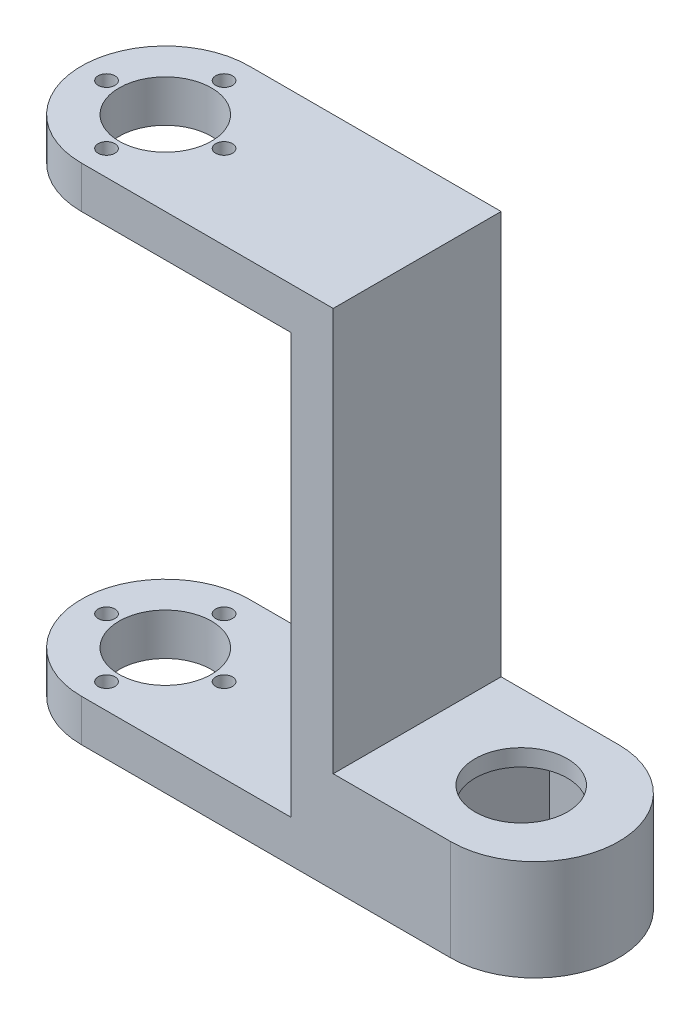
ISO-10303-21;
HEADER;
FILE_DESCRIPTION(('STEP AP214'),'2;1');
FILE_NAME('part.step','',(''),(''),'','','');
FILE_SCHEMA(('AUTOMOTIVE_DESIGN { 1 0 10303 214 1 1 1 1 }'));
ENDSEC;
DATA;
#1=APPLICATION_CONTEXT('core data for automotive mechanical design processes');
#2=APPLICATION_PROTOCOL_DEFINITION('international standard','automotive_design',2000,#1);
#3=PRODUCT_CONTEXT('',#1,'mechanical');
#4=PRODUCT('Part','Part','',(#3));
#5=PRODUCT_RELATED_PRODUCT_CATEGORY('part','',(#4));
#6=PRODUCT_DEFINITION_FORMATION('','',#4);
#7=PRODUCT_DEFINITION_CONTEXT('part definition',#1,'design');
#8=PRODUCT_DEFINITION('design','',#6,#7);
#9=PRODUCT_DEFINITION_SHAPE('','',#8);
#10=(LENGTH_UNIT() NAMED_UNIT(*) SI_UNIT(.MILLI.,.METRE.));
#11=(NAMED_UNIT(*) PLANE_ANGLE_UNIT() SI_UNIT($,.RADIAN.));
#12=(NAMED_UNIT(*) SI_UNIT($,.STERADIAN.) SOLID_ANGLE_UNIT());
#13=UNCERTAINTY_MEASURE_WITH_UNIT(LENGTH_MEASURE(1.E-05),#10,'distance_accuracy_value','');
#14=(GEOMETRIC_REPRESENTATION_CONTEXT(3) GLOBAL_UNCERTAINTY_ASSIGNED_CONTEXT((#13)) GLOBAL_UNIT_ASSIGNED_CONTEXT((#10,
#11,#12)) REPRESENTATION_CONTEXT('',''));
#15=CARTESIAN_POINT('',(0.,0.,0.));
#16=DIRECTION('',(0.,0.,1.));
#17=DIRECTION('',(1.,0.,0.));
#18=AXIS2_PLACEMENT_3D('',#15,#16,#17);
#19=CARTESIAN_POINT('',(34.,-30.,10.));
#20=DIRECTION('',(0.,-1.,0.));
#21=DIRECTION('',(1.,0.,0.));
#22=AXIS2_PLACEMENT_3D('',#19,#20,#21);
#23=CYLINDRICAL_SURFACE('',#22,10.);
#24=DIRECTION('',(0.,-1.,0.));
#25=VECTOR('',#24,1.);
#26=CARTESIAN_POINT('',(34.,0.,20.));
#27=LINE('',#26,#25);
#28=CARTESIAN_POINT('',(34.,-30.,20.));
#29=VERTEX_POINT('',#28);
#30=CARTESIAN_POINT('',(34.,-18.,20.));
#31=VERTEX_POINT('',#30);
#32=EDGE_CURVE('E327',#29,#31,#27,.F.);
#33=ORIENTED_EDGE('',*,*,#32,.F.);
#34=CARTESIAN_POINT('',(34.,-30.,10.));
#35=DIRECTION('',(0.,1.,0.));
#36=DIRECTION('',(-1.,0.,0.));
#37=AXIS2_PLACEMENT_3D('',#34,#35,#36);
#38=CIRCLE('',#37,10.);
#39=CARTESIAN_POINT('',(34.,-30.,0.));
#40=VERTEX_POINT('',#39);
#41=EDGE_CURVE('E45',#40,#29,#38,.F.);
#42=ORIENTED_EDGE('',*,*,#41,.F.);
#43=DIRECTION('',(0.,1.,0.));
#44=VECTOR('',#43,1.);
#45=CARTESIAN_POINT('',(34.,-30.,0.));
#46=LINE('',#45,#44);
#47=CARTESIAN_POINT('',(34.,-18.,0.));
#48=VERTEX_POINT('',#47);
#49=EDGE_CURVE('E342',#48,#40,#46,.F.);
#50=ORIENTED_EDGE('',*,*,#49,.F.);
#51=CARTESIAN_POINT('',(34.,-18.,10.));
#52=DIRECTION('',(0.,-1.,0.));
#53=DIRECTION('',(1.,0.,0.));
#54=AXIS2_PLACEMENT_3D('',#51,#52,#53);
#55=CIRCLE('',#54,10.);
#56=EDGE_CURVE('E11',#31,#48,#55,.F.);
#57=ORIENTED_EDGE('',*,*,#56,.F.);
#58=EDGE_LOOP('',(#33,#42,#50,#57));
#59=FACE_BOUND('',#58,.T.);
#60=ADVANCED_FACE('F37',(#59),#23,.T.);
#61=CARTESIAN_POINT('',(-10.,-25.,10.));
#62=DIRECTION('',(0.,-1.,0.));
#63=DIRECTION('',(1.,0.,0.));
#64=AXIS2_PLACEMENT_3D('',#61,#62,#63);
#65=CYLINDRICAL_SURFACE('',#64,10.);
#66=DIRECTION('',(0.,1.,0.));
#67=VECTOR('',#66,1.);
#68=CARTESIAN_POINT('',(-10.,-25.,20.));
#69=LINE('',#68,#67);
#70=CARTESIAN_POINT('',(-10.,-25.,20.));
#71=VERTEX_POINT('',#70);
#72=CARTESIAN_POINT('',(-9.99999999999999,-30.,20.));
#73=VERTEX_POINT('',#72);
#74=EDGE_CURVE('E317',#71,#73,#69,.F.);
#75=ORIENTED_EDGE('',*,*,#74,.F.);
#76=CARTESIAN_POINT('',(-10.,-25.,10.));
#77=DIRECTION('',(0.,-1.,0.));
#78=DIRECTION('',(0.,0.,-1.));
#79=AXIS2_PLACEMENT_3D('',#76,#77,#78);
#80=CIRCLE('',#79,10.);
#81=CARTESIAN_POINT('',(-10.,-25.,0.));
#82=VERTEX_POINT('',#81);
#83=EDGE_CURVE('E323',#82,#71,#80,.F.);
#84=ORIENTED_EDGE('',*,*,#83,.F.);
#85=DIRECTION('',(0.,-1.,0.));
#86=VECTOR('',#85,1.);
#87=CARTESIAN_POINT('',(-10.0000000000001,0.,0.));
#88=LINE('',#87,#86);
#89=CARTESIAN_POINT('',(-9.99999999999999,-30.,0.));
#90=VERTEX_POINT('',#89);
#91=EDGE_CURVE('E320',#90,#82,#88,.F.);
#92=ORIENTED_EDGE('',*,*,#91,.F.);
#93=CARTESIAN_POINT('',(-9.99999999999999,-30.,10.));
#94=DIRECTION('',(0.,1.,0.));
#95=DIRECTION('',(-1.,0.,0.));
#96=AXIS2_PLACEMENT_3D('',#93,#94,#95);
#97=CIRCLE('',#96,10.);
#98=EDGE_CURVE('E325',#73,#90,#97,.F.);
#99=ORIENTED_EDGE('',*,*,#98,.F.);
#100=EDGE_LOOP('',(#75,#84,#92,#99));
#101=FACE_BOUND('',#100,.T.);
#102=ADVANCED_FACE('F351',(#101),#65,.T.);
#103=CARTESIAN_POINT('',(-10.,30.,10.));
#104=DIRECTION('',(0.,-1.,0.));
#105=DIRECTION('',(0.,0.,-1.));
#106=AXIS2_PLACEMENT_3D('',#103,#104,#105);
#107=CYLINDRICAL_SURFACE('',#106,10.);
#108=DIRECTION('',(0.,1.,0.));
#109=VECTOR('',#108,1.);
#110=CARTESIAN_POINT('',(-10.,30.,20.));
#111=LINE('',#110,#109);
#112=CARTESIAN_POINT('',(-10.,30.,20.));
#113=VERTEX_POINT('',#112);
#114=CARTESIAN_POINT('',(-10.,25.,20.));
#115=VERTEX_POINT('',#114);
#116=EDGE_CURVE('E307',#113,#115,#111,.F.);
#117=ORIENTED_EDGE('',*,*,#116,.F.);
#118=CARTESIAN_POINT('',(-10.,30.,10.));
#119=DIRECTION('',(0.,-1.,0.));
#120=DIRECTION('',(1.,0.,0.));
#121=AXIS2_PLACEMENT_3D('',#118,#119,#120);
#122=CIRCLE('',#121,10.);
#123=CARTESIAN_POINT('',(-10.,30.,0.));
#124=VERTEX_POINT('',#123);
#125=EDGE_CURVE('E313',#124,#113,#122,.F.);
#126=ORIENTED_EDGE('',*,*,#125,.F.);
#127=DIRECTION('',(0.,-1.,0.));
#128=VECTOR('',#127,1.);
#129=CARTESIAN_POINT('',(-10.,0.,0.));
#130=LINE('',#129,#128);
#131=CARTESIAN_POINT('',(-10.,25.,0.));
#132=VERTEX_POINT('',#131);
#133=EDGE_CURVE('E310',#132,#124,#130,.F.);
#134=ORIENTED_EDGE('',*,*,#133,.F.);
#135=CARTESIAN_POINT('',(-10.,25.,10.));
#136=DIRECTION('',(0.,1.,0.));
#137=DIRECTION('',(-1.,0.,0.));
#138=AXIS2_PLACEMENT_3D('',#135,#136,#137);
#139=CIRCLE('',#138,10.);
#140=EDGE_CURVE('E315',#115,#132,#139,.F.);
#141=ORIENTED_EDGE('',*,*,#140,.F.);
#142=EDGE_LOOP('',(#117,#126,#134,#141));
#143=FACE_BOUND('',#142,.T.);
#144=ADVANCED_FACE('F370',(#143),#107,.T.);
#145=CARTESIAN_POINT('',(15.,25.,20.));
#146=DIRECTION('',(1.,0.,0.));
#147=DIRECTION('',(0.,1.,0.));
#148=AXIS2_PLACEMENT_3D('',#145,#146,#147);
#149=PLANE('',#148);
#150=DIRECTION('',(0.,-1.,0.));
#151=VECTOR('',#150,1.);
#152=CARTESIAN_POINT('',(15.,25.,0.));
#153=LINE('',#152,#151);
#154=CARTESIAN_POINT('',(15.,25.,0.));
#155=VERTEX_POINT('',#154);
#156=CARTESIAN_POINT('',(15.,-25.,0.));
#157=VERTEX_POINT('',#156);
#158=EDGE_CURVE('E266',#155,#157,#153,.T.);
#159=ORIENTED_EDGE('',*,*,#158,.T.);
#160=DIRECTION('',(0.,0.,-1.));
#161=VECTOR('',#160,1.);
#162=CARTESIAN_POINT('',(15.,-25.,20.));
#163=LINE('',#162,#161);
#164=CARTESIAN_POINT('',(15.,-25.,20.));
#165=VERTEX_POINT('',#164);
#166=EDGE_CURVE('E304',#165,#157,#163,.T.);
#167=ORIENTED_EDGE('',*,*,#166,.F.);
#168=DIRECTION('',(0.,-1.,0.));
#169=VECTOR('',#168,1.);
#170=CARTESIAN_POINT('',(15.,25.,20.));
#171=LINE('',#170,#169);
#172=CARTESIAN_POINT('',(15.,25.,20.));
#173=VERTEX_POINT('',#172);
#174=EDGE_CURVE('E267',#173,#165,#171,.T.);
#175=ORIENTED_EDGE('',*,*,#174,.F.);
#176=DIRECTION('',(0.,0.,-1.));
#177=VECTOR('',#176,1.);
#178=CARTESIAN_POINT('',(15.,25.,20.));
#179=LINE('',#178,#177);
#180=EDGE_CURVE('E284',#173,#155,#179,.T.);
#181=ORIENTED_EDGE('',*,*,#180,.T.);
#182=EDGE_LOOP('',(#159,#167,#175,#181));
#183=FACE_BOUND('',#182,.T.);
#184=ADVANCED_FACE('F378',(#183),#149,.F.);
#185=CARTESIAN_POINT('',(-15.,-25.,20.));
#186=DIRECTION('',(0.,-1.,0.));
#187=DIRECTION('',(0.,0.,-1.));
#188=AXIS2_PLACEMENT_3D('',#185,#186,#187);
#189=PLANE('',#188);
#190=CARTESIAN_POINT('',(-10.,-25.,3.));
#191=DIRECTION('',(0.,-1.,0.));
#192=DIRECTION('',(0.,0.,-1.));
#193=AXIS2_PLACEMENT_3D('',#190,#191,#192);
#194=CIRCLE('',#193,1.);
#195=CARTESIAN_POINT('',(-10.,-25.,2.));
#196=VERTEX_POINT('',#195);
#197=EDGE_CURVE('E263',#196,#196,#194,.T.);
#198=ORIENTED_EDGE('',*,*,#197,.T.);
#199=EDGE_LOOP('',(#198));
#200=FACE_BOUND('',#199,.T.);
#201=CARTESIAN_POINT('',(-10.,-25.,10.));
#202=DIRECTION('',(0.,-1.,0.));
#203=DIRECTION('',(0.,0.,-1.));
#204=AXIS2_PLACEMENT_3D('',#201,#202,#203);
#205=CIRCLE('',#204,5.5);
#206=CARTESIAN_POINT('',(-10.,-25.,4.5));
#207=VERTEX_POINT('',#206);
#208=EDGE_CURVE('E259',#207,#207,#205,.T.);
#209=ORIENTED_EDGE('',*,*,#208,.T.);
#210=EDGE_LOOP('',(#209));
#211=FACE_BOUND('',#210,.T.);
#212=CARTESIAN_POINT('',(-3.,-25.,10.));
#213=DIRECTION('',(0.,-1.,0.));
#214=DIRECTION('',(0.,0.,-1.));
#215=AXIS2_PLACEMENT_3D('',#212,#213,#214);
#216=CIRCLE('',#215,1.);
#217=CARTESIAN_POINT('',(-3.,-25.,9.));
#218=VERTEX_POINT('',#217);
#219=EDGE_CURVE('E255',#218,#218,#216,.T.);
#220=ORIENTED_EDGE('',*,*,#219,.T.);
#221=EDGE_LOOP('',(#220));
#222=FACE_BOUND('',#221,.T.);
#223=CARTESIAN_POINT('',(-10.,-25.,17.));
#224=DIRECTION('',(0.,-1.,0.));
#225=DIRECTION('',(0.,0.,-1.));
#226=AXIS2_PLACEMENT_3D('',#223,#224,#225);
#227=CIRCLE('',#226,1.);
#228=CARTESIAN_POINT('',(-10.,-25.,16.));
#229=VERTEX_POINT('',#228);
#230=EDGE_CURVE('E251',#229,#229,#227,.T.);
#231=ORIENTED_EDGE('',*,*,#230,.T.);
#232=EDGE_LOOP('',(#231));
#233=FACE_BOUND('',#232,.T.);
#234=CARTESIAN_POINT('',(-17.,-25.,10.));
#235=DIRECTION('',(0.,-1.,0.));
#236=DIRECTION('',(0.,0.,-1.));
#237=AXIS2_PLACEMENT_3D('',#234,#235,#236);
#238=CIRCLE('',#237,1.);
#239=CARTESIAN_POINT('',(-17.,-25.,9.));
#240=VERTEX_POINT('',#239);
#241=EDGE_CURVE('E247',#240,#240,#238,.T.);
#242=ORIENTED_EDGE('',*,*,#241,.T.);
#243=EDGE_LOOP('',(#242));
#244=FACE_BOUND('',#243,.T.);
#245=DIRECTION('',(-1.,0.,0.));
#246=VECTOR('',#245,1.);
#247=CARTESIAN_POINT('',(-15.,-25.,0.));
#248=LINE('',#247,#246);
#249=EDGE_CURVE('E287',#157,#82,#248,.T.);
#250=ORIENTED_EDGE('',*,*,#249,.T.);
#251=ORIENTED_EDGE('',*,*,#83,.T.);
#252=DIRECTION('',(-1.,0.,0.));
#253=VECTOR('',#252,1.);
#254=CARTESIAN_POINT('',(-15.,-25.,20.));
#255=LINE('',#254,#253);
#256=EDGE_CURVE('E270',#165,#71,#255,.T.);
#257=ORIENTED_EDGE('',*,*,#256,.F.);
#258=ORIENTED_EDGE('',*,*,#166,.T.);
#259=EDGE_LOOP('',(#250,#251,#257,#258));
#260=FACE_BOUND('',#259,.T.);
#261=ADVANCED_FACE('F381',(#200,#211,#222,#233,#244,#260),#189,.F.);
#262=CARTESIAN_POINT('',(-20.,-30.,20.));
#263=DIRECTION('',(0.,1.,0.));
#264=DIRECTION('',(-1.,0.,0.));
#265=AXIS2_PLACEMENT_3D('',#262,#263,#264);
#266=PLANE('',#265);
#267=DIRECTION('',(0.500839461349423,0.,0.865540197769705));
#268=VECTOR('',#267,1.);
#269=CARTESIAN_POINT('',(37.1297855594556,-30.,1.09502198501678));
#270=LINE('',#269,#268);
#271=CARTESIAN_POINT('',(37.1297855594556,-30.,1.09502198501678));
#272=VERTEX_POINT('',#271);
#273=CARTESIAN_POINT('',(42.2768299608452,-30.,9.99003560296349));
#274=VERTEX_POINT('',#273);
#275=EDGE_CURVE('E188',#272,#274,#270,.T.);
#276=ORIENTED_EDGE('',*,*,#275,.F.);
#277=DIRECTION('',(0.999999529939883,0.,-0.000969597861462165));
#278=VECTOR('',#277,1.);
#279=CARTESIAN_POINT('',(26.8529555986104,-30.,1.1049863820533));
#280=LINE('',#279,#278);
#281=CARTESIAN_POINT('',(26.8529555986104,-30.,1.1049863820533));
#282=VERTEX_POINT('',#281);
#283=EDGE_CURVE('E154',#282,#272,#280,.T.);
#284=ORIENTED_EDGE('',*,*,#283,.F.);
#285=DIRECTION('',(0.49916006859046,0.,-0.866509795631167));
#286=VECTOR('',#285,1.);
#287=CARTESIAN_POINT('',(21.7231700391548,-30.,10.0099643970365));
#288=LINE('',#287,#286);
#289=CARTESIAN_POINT('',(21.7231700391548,-30.,10.0099643970365));
#290=VERTEX_POINT('',#289);
#291=EDGE_CURVE('E172',#290,#282,#288,.T.);
#292=ORIENTED_EDGE('',*,*,#291,.F.);
#293=DIRECTION('',(-0.500839461349423,0.,-0.865540197769705));
#294=VECTOR('',#293,1.);
#295=CARTESIAN_POINT('',(26.8702144405444,-30.,18.9049780149832));
#296=LINE('',#295,#294);
#297=CARTESIAN_POINT('',(26.8702144405444,-30.,18.9049780149832));
#298=VERTEX_POINT('',#297);
#299=EDGE_CURVE('E175',#298,#290,#296,.T.);
#300=ORIENTED_EDGE('',*,*,#299,.F.);
#301=DIRECTION('',(-0.999999529939883,0.,0.00096959786146227));
#302=VECTOR('',#301,1.);
#303=CARTESIAN_POINT('',(37.1470444013896,-30.,18.8950136179467));
#304=LINE('',#303,#302);
#305=CARTESIAN_POINT('',(37.1470444013896,-30.,18.8950136179467));
#306=VERTEX_POINT('',#305);
#307=EDGE_CURVE('E194',#306,#298,#304,.T.);
#308=ORIENTED_EDGE('',*,*,#307,.F.);
#309=DIRECTION('',(-0.499160068590461,0.,0.866509795631167));
#310=VECTOR('',#309,1.);
#311=CARTESIAN_POINT('',(42.2768299608452,-30.,9.99003560296349));
#312=LINE('',#311,#310);
#313=EDGE_CURVE('E191',#274,#306,#312,.T.);
#314=ORIENTED_EDGE('',*,*,#313,.F.);
#315=EDGE_LOOP('',(#276,#284,#292,#300,#308,#314));
#316=FACE_BOUND('',#315,.T.);
#317=CARTESIAN_POINT('',(-9.99999999999999,-30.,3.));
#318=DIRECTION('',(0.,1.,0.));
#319=DIRECTION('',(-1.,0.,0.));
#320=AXIS2_PLACEMENT_3D('',#317,#318,#319);
#321=CIRCLE('',#320,1.);
#322=CARTESIAN_POINT('',(-11.,-30.,3.));
#323=VERTEX_POINT('',#322);
#324=EDGE_CURVE('E217',#323,#323,#321,.T.);
#325=ORIENTED_EDGE('',*,*,#324,.T.);
#326=EDGE_LOOP('',(#325));
#327=FACE_BOUND('',#326,.T.);
#328=CARTESIAN_POINT('',(-9.99999999999999,-30.,10.));
#329=DIRECTION('',(0.,1.,0.));
#330=DIRECTION('',(-1.,0.,0.));
#331=AXIS2_PLACEMENT_3D('',#328,#329,#330);
#332=CIRCLE('',#331,5.5);
#333=CARTESIAN_POINT('',(-15.5,-30.,10.));
#334=VERTEX_POINT('',#333);
#335=EDGE_CURVE('E232',#334,#334,#332,.T.);
#336=ORIENTED_EDGE('',*,*,#335,.T.);
#337=EDGE_LOOP('',(#336));
#338=FACE_BOUND('',#337,.T.);
#339=CARTESIAN_POINT('',(-2.99999999999999,-30.,10.));
#340=DIRECTION('',(0.,1.,0.));
#341=DIRECTION('',(-1.,0.,0.));
#342=AXIS2_PLACEMENT_3D('',#339,#340,#341);
#343=CIRCLE('',#342,1.);
#344=CARTESIAN_POINT('',(-3.99999999999999,-30.,10.));
#345=VERTEX_POINT('',#344);
#346=EDGE_CURVE('E225',#345,#345,#343,.T.);
#347=ORIENTED_EDGE('',*,*,#346,.T.);
#348=EDGE_LOOP('',(#347));
#349=FACE_BOUND('',#348,.T.);
#350=CARTESIAN_POINT('',(-9.99999999999999,-30.,17.));
#351=DIRECTION('',(0.,1.,0.));
#352=DIRECTION('',(-1.,0.,0.));
#353=AXIS2_PLACEMENT_3D('',#350,#351,#352);
#354=CIRCLE('',#353,1.);
#355=CARTESIAN_POINT('',(-11.,-30.,17.));
#356=VERTEX_POINT('',#355);
#357=EDGE_CURVE('E242',#356,#356,#354,.T.);
#358=ORIENTED_EDGE('',*,*,#357,.T.);
#359=EDGE_LOOP('',(#358));
#360=FACE_BOUND('',#359,.T.);
#361=CARTESIAN_POINT('',(-17.,-30.,10.));
#362=DIRECTION('',(0.,1.,0.));
#363=DIRECTION('',(-1.,0.,0.));
#364=AXIS2_PLACEMENT_3D('',#361,#362,#363);
#365=CIRCLE('',#364,1.);
#366=CARTESIAN_POINT('',(-18.,-30.,10.));
#367=VERTEX_POINT('',#366);
#368=EDGE_CURVE('E224',#367,#367,#365,.T.);
#369=ORIENTED_EDGE('',*,*,#368,.T.);
#370=EDGE_LOOP('',(#369));
#371=FACE_BOUND('',#370,.T.);
#372=DIRECTION('',(1.,0.,0.));
#373=VECTOR('',#372,1.);
#374=CARTESIAN_POINT('',(-20.,-30.,0.));
#375=LINE('',#374,#373);
#376=EDGE_CURVE('E290',#90,#40,#375,.T.);
#377=ORIENTED_EDGE('',*,*,#376,.T.);
#378=ORIENTED_EDGE('',*,*,#41,.T.);
#379=DIRECTION('',(1.,0.,0.));
#380=VECTOR('',#379,1.);
#381=CARTESIAN_POINT('',(-20.,-30.,20.));
#382=LINE('',#381,#380);
#383=EDGE_CURVE('E274',#73,#29,#382,.T.);
#384=ORIENTED_EDGE('',*,*,#383,.F.);
#385=ORIENTED_EDGE('',*,*,#98,.T.);
#386=EDGE_LOOP('',(#377,#378,#384,#385));
#387=FACE_BOUND('',#386,.T.);
#388=ADVANCED_FACE('F345',(#316,#327,#338,#349,#360,#371,#387),#266,.F.);
#389=CARTESIAN_POINT('',(20.,30.,20.));
#390=DIRECTION('',(-1.,0.,0.));
#391=DIRECTION('',(0.,-1.,0.));
#392=AXIS2_PLACEMENT_3D('',#389,#390,#391);
#393=PLANE('',#392);
#394=DIRECTION('',(0.,1.,0.));
#395=VECTOR('',#394,1.);
#396=CARTESIAN_POINT('',(20.,30.,20.));
#397=LINE('',#396,#395);
#398=CARTESIAN_POINT('',(20.,-18.,20.));
#399=VERTEX_POINT('',#398);
#400=CARTESIAN_POINT('',(20.,30.,20.));
#401=VERTEX_POINT('',#400);
#402=EDGE_CURVE('E277',#399,#401,#397,.T.);
#403=ORIENTED_EDGE('',*,*,#402,.F.);
#404=DIRECTION('',(0.,0.,-1.));
#405=VECTOR('',#404,1.);
#406=CARTESIAN_POINT('',(20.,-18.,20.));
#407=LINE('',#406,#405);
#408=CARTESIAN_POINT('',(20.,-18.,0.));
#409=VERTEX_POINT('',#408);
#410=EDGE_CURVE('E201',#399,#409,#407,.T.);
#411=ORIENTED_EDGE('',*,*,#410,.T.);
#412=DIRECTION('',(0.,1.,0.));
#413=VECTOR('',#412,1.);
#414=CARTESIAN_POINT('',(20.,30.,0.));
#415=LINE('',#414,#413);
#416=CARTESIAN_POINT('',(20.,30.,0.));
#417=VERTEX_POINT('',#416);
#418=EDGE_CURVE('E293',#409,#417,#415,.T.);
#419=ORIENTED_EDGE('',*,*,#418,.T.);
#420=DIRECTION('',(0.,0.,-1.));
#421=VECTOR('',#420,1.);
#422=CARTESIAN_POINT('',(20.,30.,20.));
#423=LINE('',#422,#421);
#424=EDGE_CURVE('E301',#401,#417,#423,.T.);
#425=ORIENTED_EDGE('',*,*,#424,.F.);
#426=EDGE_LOOP('',(#403,#411,#419,#425));
#427=FACE_BOUND('',#426,.T.);
#428=ADVANCED_FACE('F361',(#427),#393,.F.);
#429=CARTESIAN_POINT('',(-20.,30.,20.));
#430=DIRECTION('',(0.,-1.,0.));
#431=DIRECTION('',(1.,0.,0.));
#432=AXIS2_PLACEMENT_3D('',#429,#430,#431);
#433=PLANE('',#432);
#434=CARTESIAN_POINT('',(-10.,30.,3.));
#435=DIRECTION('',(0.,1.,0.));
#436=DIRECTION('',(-1.,0.,0.));
#437=AXIS2_PLACEMENT_3D('',#434,#435,#436);
#438=CIRCLE('',#437,1.);
#439=CARTESIAN_POINT('',(-11.,30.,3.));
#440=VERTEX_POINT('',#439);
#441=EDGE_CURVE('E221',#440,#440,#438,.T.);
#442=ORIENTED_EDGE('',*,*,#441,.F.);
#443=EDGE_LOOP('',(#442));
#444=FACE_BOUND('',#443,.T.);
#445=CARTESIAN_POINT('',(-10.,30.,10.));
#446=DIRECTION('',(0.,1.,0.));
#447=DIRECTION('',(-1.,0.,0.));
#448=AXIS2_PLACEMENT_3D('',#445,#446,#447);
#449=CIRCLE('',#448,5.5);
#450=CARTESIAN_POINT('',(-15.5,30.,10.));
#451=VERTEX_POINT('',#450);
#452=EDGE_CURVE('E216',#451,#451,#449,.T.);
#453=ORIENTED_EDGE('',*,*,#452,.F.);
#454=EDGE_LOOP('',(#453));
#455=FACE_BOUND('',#454,.T.);
#456=CARTESIAN_POINT('',(-3.00000000000001,30.,10.));
#457=DIRECTION('',(0.,1.,0.));
#458=DIRECTION('',(-1.,0.,0.));
#459=AXIS2_PLACEMENT_3D('',#456,#457,#458);
#460=CIRCLE('',#459,1.);
#461=CARTESIAN_POINT('',(-4.00000000000001,30.,10.));
#462=VERTEX_POINT('',#461);
#463=EDGE_CURVE('E229',#462,#462,#460,.T.);
#464=ORIENTED_EDGE('',*,*,#463,.F.);
#465=EDGE_LOOP('',(#464));
#466=FACE_BOUND('',#465,.T.);
#467=CARTESIAN_POINT('',(-10.,30.,17.));
#468=DIRECTION('',(0.,1.,0.));
#469=DIRECTION('',(-1.,0.,0.));
#470=AXIS2_PLACEMENT_3D('',#467,#468,#469);
#471=CIRCLE('',#470,1.);
#472=CARTESIAN_POINT('',(-11.,30.,17.));
#473=VERTEX_POINT('',#472);
#474=EDGE_CURVE('E228',#473,#473,#471,.T.);
#475=ORIENTED_EDGE('',*,*,#474,.F.);
#476=EDGE_LOOP('',(#475));
#477=FACE_BOUND('',#476,.T.);
#478=CARTESIAN_POINT('',(-17.,30.,10.));
#479=DIRECTION('',(0.,1.,0.));
#480=DIRECTION('',(-1.,0.,0.));
#481=AXIS2_PLACEMENT_3D('',#478,#479,#480);
#482=CIRCLE('',#481,1.);
#483=CARTESIAN_POINT('',(-18.,30.,10.));
#484=VERTEX_POINT('',#483);
#485=EDGE_CURVE('E239',#484,#484,#482,.T.);
#486=ORIENTED_EDGE('',*,*,#485,.F.);
#487=EDGE_LOOP('',(#486));
#488=FACE_BOUND('',#487,.T.);
#489=DIRECTION('',(-1.,0.,0.));
#490=VECTOR('',#489,1.);
#491=CARTESIAN_POINT('',(-20.,30.,0.));
#492=LINE('',#491,#490);
#493=EDGE_CURVE('E295',#417,#124,#492,.T.);
#494=ORIENTED_EDGE('',*,*,#493,.T.);
#495=ORIENTED_EDGE('',*,*,#125,.T.);
#496=DIRECTION('',(-1.,0.,0.));
#497=VECTOR('',#496,1.);
#498=CARTESIAN_POINT('',(-20.,30.,20.));
#499=LINE('',#498,#497);
#500=EDGE_CURVE('E279',#401,#113,#499,.T.);
#501=ORIENTED_EDGE('',*,*,#500,.F.);
#502=ORIENTED_EDGE('',*,*,#424,.T.);
#503=EDGE_LOOP('',(#494,#495,#501,#502));
#504=FACE_BOUND('',#503,.T.);
#505=ADVANCED_FACE('F367',(#444,#455,#466,#477,#488,#504),#433,.F.);
#506=CARTESIAN_POINT('',(-15.,25.,20.));
#507=DIRECTION('',(0.,1.,0.));
#508=DIRECTION('',(-1.,0.,0.));
#509=AXIS2_PLACEMENT_3D('',#506,#507,#508);
#510=PLANE('',#509);
#511=CARTESIAN_POINT('',(-10.,25.,3.));
#512=DIRECTION('',(0.,1.,0.));
#513=DIRECTION('',(-1.,0.,0.));
#514=AXIS2_PLACEMENT_3D('',#511,#512,#513);
#515=CIRCLE('',#514,1.);
#516=CARTESIAN_POINT('',(-11.,25.,3.));
#517=VERTEX_POINT('',#516);
#518=EDGE_CURVE('E262',#517,#517,#515,.T.);
#519=ORIENTED_EDGE('',*,*,#518,.T.);
#520=EDGE_LOOP('',(#519));
#521=FACE_BOUND('',#520,.T.);
#522=CARTESIAN_POINT('',(-10.,25.,10.));
#523=DIRECTION('',(0.,1.,0.));
#524=DIRECTION('',(-1.,0.,0.));
#525=AXIS2_PLACEMENT_3D('',#522,#523,#524);
#526=CIRCLE('',#525,5.5);
#527=CARTESIAN_POINT('',(-15.5,25.,10.));
#528=VERTEX_POINT('',#527);
#529=EDGE_CURVE('E258',#528,#528,#526,.T.);
#530=ORIENTED_EDGE('',*,*,#529,.T.);
#531=EDGE_LOOP('',(#530));
#532=FACE_BOUND('',#531,.T.);
#533=CARTESIAN_POINT('',(-3.00000000000001,25.,10.));
#534=DIRECTION('',(0.,1.,0.));
#535=DIRECTION('',(-1.,0.,0.));
#536=AXIS2_PLACEMENT_3D('',#533,#534,#535);
#537=CIRCLE('',#536,1.);
#538=CARTESIAN_POINT('',(-4.00000000000001,25.,10.));
#539=VERTEX_POINT('',#538);
#540=EDGE_CURVE('E254',#539,#539,#537,.T.);
#541=ORIENTED_EDGE('',*,*,#540,.T.);
#542=EDGE_LOOP('',(#541));
#543=FACE_BOUND('',#542,.T.);
#544=CARTESIAN_POINT('',(-10.,25.,17.));
#545=DIRECTION('',(0.,1.,0.));
#546=DIRECTION('',(-1.,0.,0.));
#547=AXIS2_PLACEMENT_3D('',#544,#545,#546);
#548=CIRCLE('',#547,1.);
#549=CARTESIAN_POINT('',(-11.,25.,17.));
#550=VERTEX_POINT('',#549);
#551=EDGE_CURVE('E250',#550,#550,#548,.T.);
#552=ORIENTED_EDGE('',*,*,#551,.T.);
#553=EDGE_LOOP('',(#552));
#554=FACE_BOUND('',#553,.T.);
#555=CARTESIAN_POINT('',(-17.,25.,10.));
#556=DIRECTION('',(0.,1.,0.));
#557=DIRECTION('',(-1.,0.,0.));
#558=AXIS2_PLACEMENT_3D('',#555,#556,#557);
#559=CIRCLE('',#558,1.);
#560=CARTESIAN_POINT('',(-18.,25.,10.));
#561=VERTEX_POINT('',#560);
#562=EDGE_CURVE('E220',#561,#561,#559,.T.);
#563=ORIENTED_EDGE('',*,*,#562,.T.);
#564=EDGE_LOOP('',(#563));
#565=FACE_BOUND('',#564,.T.);
#566=DIRECTION('',(1.,0.,0.));
#567=VECTOR('',#566,1.);
#568=CARTESIAN_POINT('',(-15.,25.,20.));
#569=LINE('',#568,#567);
#570=EDGE_CURVE('E282',#115,#173,#569,.T.);
#571=ORIENTED_EDGE('',*,*,#570,.F.);
#572=ORIENTED_EDGE('',*,*,#140,.T.);
#573=DIRECTION('',(1.,0.,0.));
#574=VECTOR('',#573,1.);
#575=CARTESIAN_POINT('',(-15.,25.,0.));
#576=LINE('',#575,#574);
#577=EDGE_CURVE('E271',#132,#155,#576,.T.);
#578=ORIENTED_EDGE('',*,*,#577,.T.);
#579=ORIENTED_EDGE('',*,*,#180,.F.);
#580=EDGE_LOOP('',(#571,#572,#578,#579));
#581=FACE_BOUND('',#580,.T.);
#582=ADVANCED_FACE('F373',(#521,#532,#543,#554,#565,#581),#510,.F.);
#583=CARTESIAN_POINT('',(0.,0.,20.));
#584=DIRECTION('',(0.,0.,1.));
#585=DIRECTION('',(1.,0.,0.));
#586=AXIS2_PLACEMENT_3D('',#583,#584,#585);
#587=PLANE('',#586);
#588=ORIENTED_EDGE('',*,*,#383,.T.);
#589=ORIENTED_EDGE('',*,*,#32,.T.);
#590=DIRECTION('',(-1.,0.,0.));
#591=VECTOR('',#590,1.);
#592=CARTESIAN_POINT('',(20.,-18.,20.));
#593=LINE('',#592,#591);
#594=EDGE_CURVE('E214',#31,#399,#593,.T.);
#595=ORIENTED_EDGE('',*,*,#594,.T.);
#596=ORIENTED_EDGE('',*,*,#402,.T.);
#597=ORIENTED_EDGE('',*,*,#500,.T.);
#598=ORIENTED_EDGE('',*,*,#116,.T.);
#599=ORIENTED_EDGE('',*,*,#570,.T.);
#600=ORIENTED_EDGE('',*,*,#174,.T.);
#601=ORIENTED_EDGE('',*,*,#256,.T.);
#602=ORIENTED_EDGE('',*,*,#74,.T.);
#603=EDGE_LOOP('',(#588,#589,#595,#596,#597,#598,#599,#600,#601,#602));
#604=FACE_BOUND('',#603,.T.);
#605=ADVANCED_FACE('F348',(#604),#587,.T.);
#606=CARTESIAN_POINT('',(0.,0.,0.));
#607=DIRECTION('',(0.,0.,1.));
#608=DIRECTION('',(1.,0.,0.));
#609=AXIS2_PLACEMENT_3D('',#606,#607,#608);
#610=PLANE('',#609);
#611=DIRECTION('',(1.,0.,0.));
#612=VECTOR('',#611,1.);
#613=CARTESIAN_POINT('',(20.,-18.,0.));
#614=LINE('',#613,#612);
#615=EDGE_CURVE('E211',#409,#48,#614,.T.);
#616=ORIENTED_EDGE('',*,*,#615,.T.);
#617=ORIENTED_EDGE('',*,*,#49,.T.);
#618=ORIENTED_EDGE('',*,*,#376,.F.);
#619=ORIENTED_EDGE('',*,*,#91,.T.);
#620=ORIENTED_EDGE('',*,*,#249,.F.);
#621=ORIENTED_EDGE('',*,*,#158,.F.);
#622=ORIENTED_EDGE('',*,*,#577,.F.);
#623=ORIENTED_EDGE('',*,*,#133,.T.);
#624=ORIENTED_EDGE('',*,*,#493,.F.);
#625=ORIENTED_EDGE('',*,*,#418,.F.);
#626=EDGE_LOOP('',(#616,#617,#618,#619,#620,#621,#622,#623,#624,#625));
#627=FACE_BOUND('',#626,.T.);
#628=ADVANCED_FACE('F354',(#627),#610,.F.);
#629=CARTESIAN_POINT('',(-17.,-30.,10.));
#630=DIRECTION('',(0.,1.,0.));
#631=DIRECTION('',(-1.,0.,0.));
#632=AXIS2_PLACEMENT_3D('',#629,#630,#631);
#633=CYLINDRICAL_SURFACE('',#632,1.);
#634=ORIENTED_EDGE('',*,*,#485,.T.);
#635=EDGE_LOOP('',(#634));
#636=FACE_BOUND('',#635,.T.);
#637=ORIENTED_EDGE('',*,*,#562,.F.);
#638=EDGE_LOOP('',(#637));
#639=FACE_BOUND('',#638,.T.);
#640=ADVANCED_FACE('F477',(#636,#639),#633,.F.);
#641=CARTESIAN_POINT('',(-9.99999999999999,-30.,17.));
#642=DIRECTION('',(0.,1.,0.));
#643=DIRECTION('',(-1.,0.,0.));
#644=AXIS2_PLACEMENT_3D('',#641,#642,#643);
#645=CYLINDRICAL_SURFACE('',#644,1.);
#646=ORIENTED_EDGE('',*,*,#474,.T.);
#647=EDGE_LOOP('',(#646));
#648=FACE_BOUND('',#647,.T.);
#649=ORIENTED_EDGE('',*,*,#551,.F.);
#650=EDGE_LOOP('',(#649));
#651=FACE_BOUND('',#650,.T.);
#652=ADVANCED_FACE('F494',(#648,#651),#645,.F.);
#653=CARTESIAN_POINT('',(-2.99999999999999,-30.,10.));
#654=DIRECTION('',(0.,1.,0.));
#655=DIRECTION('',(-1.,0.,0.));
#656=AXIS2_PLACEMENT_3D('',#653,#654,#655);
#657=CYLINDRICAL_SURFACE('',#656,1.);
#658=ORIENTED_EDGE('',*,*,#463,.T.);
#659=EDGE_LOOP('',(#658));
#660=FACE_BOUND('',#659,.T.);
#661=ORIENTED_EDGE('',*,*,#540,.F.);
#662=EDGE_LOOP('',(#661));
#663=FACE_BOUND('',#662,.T.);
#664=ADVANCED_FACE('F504',(#660,#663),#657,.F.);
#665=CARTESIAN_POINT('',(-9.99999999999999,-30.,10.));
#666=DIRECTION('',(0.,1.,0.));
#667=DIRECTION('',(-1.,0.,0.));
#668=AXIS2_PLACEMENT_3D('',#665,#666,#667);
#669=CYLINDRICAL_SURFACE('',#668,5.5);
#670=ORIENTED_EDGE('',*,*,#452,.T.);
#671=EDGE_LOOP('',(#670));
#672=FACE_BOUND('',#671,.T.);
#673=ORIENTED_EDGE('',*,*,#529,.F.);
#674=EDGE_LOOP('',(#673));
#675=FACE_BOUND('',#674,.T.);
#676=ADVANCED_FACE('F514',(#672,#675),#669,.F.);
#677=CARTESIAN_POINT('',(-9.99999999999999,-30.,3.));
#678=DIRECTION('',(0.,1.,0.));
#679=DIRECTION('',(-1.,0.,0.));
#680=AXIS2_PLACEMENT_3D('',#677,#678,#679);
#681=CYLINDRICAL_SURFACE('',#680,1.);
#682=ORIENTED_EDGE('',*,*,#441,.T.);
#683=EDGE_LOOP('',(#682));
#684=FACE_BOUND('',#683,.T.);
#685=ORIENTED_EDGE('',*,*,#518,.F.);
#686=EDGE_LOOP('',(#685));
#687=FACE_BOUND('',#686,.T.);
#688=ADVANCED_FACE('F524',(#684,#687),#681,.F.);
#689=ORIENTED_EDGE('',*,*,#368,.F.);
#690=EDGE_LOOP('',(#689));
#691=FACE_BOUND('',#690,.T.);
#692=ORIENTED_EDGE('',*,*,#241,.F.);
#693=EDGE_LOOP('',(#692));
#694=FACE_BOUND('',#693,.T.);
#695=ADVANCED_FACE('F497',(#691,#694),#633,.F.);
#696=ORIENTED_EDGE('',*,*,#357,.F.);
#697=EDGE_LOOP('',(#696));
#698=FACE_BOUND('',#697,.T.);
#699=ORIENTED_EDGE('',*,*,#230,.F.);
#700=EDGE_LOOP('',(#699));
#701=FACE_BOUND('',#700,.T.);
#702=ADVANCED_FACE('F507',(#698,#701),#645,.F.);
#703=ORIENTED_EDGE('',*,*,#346,.F.);
#704=EDGE_LOOP('',(#703));
#705=FACE_BOUND('',#704,.T.);
#706=ORIENTED_EDGE('',*,*,#219,.F.);
#707=EDGE_LOOP('',(#706));
#708=FACE_BOUND('',#707,.T.);
#709=ADVANCED_FACE('F517',(#705,#708),#657,.F.);
#710=ORIENTED_EDGE('',*,*,#335,.F.);
#711=EDGE_LOOP('',(#710));
#712=FACE_BOUND('',#711,.T.);
#713=ORIENTED_EDGE('',*,*,#208,.F.);
#714=EDGE_LOOP('',(#713));
#715=FACE_BOUND('',#714,.T.);
#716=ADVANCED_FACE('F527',(#712,#715),#669,.F.);
#717=ORIENTED_EDGE('',*,*,#324,.F.);
#718=EDGE_LOOP('',(#717));
#719=FACE_BOUND('',#718,.T.);
#720=ORIENTED_EDGE('',*,*,#197,.F.);
#721=EDGE_LOOP('',(#720));
#722=FACE_BOUND('',#721,.T.);
#723=ADVANCED_FACE('F536',(#719,#722),#681,.F.);
#724=CARTESIAN_POINT('',(0.,-18.,0.));
#725=DIRECTION('',(0.,-1.,0.));
#726=DIRECTION('',(1.,0.,0.));
#727=AXIS2_PLACEMENT_3D('',#724,#725,#726);
#728=PLANE('',#727);
#729=CARTESIAN_POINT('',(32.3903591301354,-18.,10.));
#730=DIRECTION('',(0.,-1.,0.));
#731=DIRECTION('',(1.,0.,0.));
#732=AXIS2_PLACEMENT_3D('',#729,#730,#731);
#733=CIRCLE('',#732,5.5);
#734=CARTESIAN_POINT('',(37.8903591301354,-18.,10.));
#735=VERTEX_POINT('',#734);
#736=EDGE_CURVE('E189',#735,#735,#733,.T.);
#737=ORIENTED_EDGE('',*,*,#736,.T.);
#738=EDGE_LOOP('',(#737));
#739=FACE_BOUND('',#738,.T.);
#740=ORIENTED_EDGE('',*,*,#594,.F.);
#741=ORIENTED_EDGE('',*,*,#56,.T.);
#742=ORIENTED_EDGE('',*,*,#615,.F.);
#743=ORIENTED_EDGE('',*,*,#410,.F.);
#744=EDGE_LOOP('',(#740,#741,#742,#743));
#745=FACE_BOUND('',#744,.T.);
#746=ADVANCED_FACE('F358',(#739,#745),#728,.F.);
#747=CARTESIAN_POINT('',(26.8529555986104,-20.,1.1049863820533));
#748=DIRECTION('',(-0.000969597861462165,0.,-0.999999529939883));
#749=DIRECTION('',(-0.999999529939883,0.,0.000969597861462165));
#750=AXIS2_PLACEMENT_3D('',#747,#748,#749);
#751=PLANE('',#750);
#752=ORIENTED_EDGE('',*,*,#283,.T.);
#753=DIRECTION('',(0.,-1.,0.));
#754=VECTOR('',#753,1.);
#755=CARTESIAN_POINT('',(37.1297855594556,-20.,1.09502198501678));
#756=LINE('',#755,#754);
#757=CARTESIAN_POINT('',(37.1297855594556,-20.,1.09502198501678));
#758=VERTEX_POINT('',#757);
#759=EDGE_CURVE('E147',#758,#272,#756,.T.);
#760=ORIENTED_EDGE('',*,*,#759,.F.);
#761=DIRECTION('',(0.999999529939883,0.,-0.000969597861462165));
#762=VECTOR('',#761,1.);
#763=CARTESIAN_POINT('',(26.8529555986104,-20.,1.1049863820533));
#764=LINE('',#763,#762);
#765=CARTESIAN_POINT('',(26.8529555986104,-20.,1.1049863820533));
#766=VERTEX_POINT('',#765);
#767=EDGE_CURVE('E151',#766,#758,#764,.T.);
#768=ORIENTED_EDGE('',*,*,#767,.F.);
#769=DIRECTION('',(0.,-1.,0.));
#770=VECTOR('',#769,1.);
#771=CARTESIAN_POINT('',(26.8529555986104,-20.,1.1049863820533));
#772=LINE('',#771,#770);
#773=EDGE_CURVE('E199',#766,#282,#772,.T.);
#774=ORIENTED_EDGE('',*,*,#773,.T.);
#775=EDGE_LOOP('',(#752,#760,#768,#774));
#776=FACE_BOUND('',#775,.T.);
#777=ADVANCED_FACE('F149',(#776),#751,.F.);
#778=CARTESIAN_POINT('',(21.7231700391548,-20.,10.0099643970365));
#779=DIRECTION('',(-0.866509795631167,0.,-0.49916006859046));
#780=DIRECTION('',(-0.49916006859046,0.,0.866509795631167));
#781=AXIS2_PLACEMENT_3D('',#778,#779,#780);
#782=PLANE('',#781);
#783=ORIENTED_EDGE('',*,*,#291,.T.);
#784=ORIENTED_EDGE('',*,*,#773,.F.);
#785=DIRECTION('',(0.49916006859046,0.,-0.866509795631167));
#786=VECTOR('',#785,1.);
#787=CARTESIAN_POINT('',(21.7231700391548,-20.,10.0099643970365));
#788=LINE('',#787,#786);
#789=CARTESIAN_POINT('',(21.7231700391548,-20.,10.0099643970365));
#790=VERTEX_POINT('',#789);
#791=EDGE_CURVE('E159',#790,#766,#788,.T.);
#792=ORIENTED_EDGE('',*,*,#791,.F.);
#793=DIRECTION('',(0.,-1.,0.));
#794=VECTOR('',#793,1.);
#795=CARTESIAN_POINT('',(21.7231700391548,-20.,10.0099643970365));
#796=LINE('',#795,#794);
#797=EDGE_CURVE('E202',#790,#290,#796,.T.);
#798=ORIENTED_EDGE('',*,*,#797,.T.);
#799=EDGE_LOOP('',(#783,#784,#792,#798));
#800=FACE_BOUND('',#799,.T.);
#801=ADVANCED_FACE('F581',(#800),#782,.F.);
#802=CARTESIAN_POINT('',(26.8702144405444,-20.,18.9049780149832));
#803=DIRECTION('',(-0.865540197769705,0.,0.500839461349423));
#804=DIRECTION('',(0.500839461349423,0.,0.865540197769705));
#805=AXIS2_PLACEMENT_3D('',#802,#803,#804);
#806=PLANE('',#805);
#807=ORIENTED_EDGE('',*,*,#299,.T.);
#808=ORIENTED_EDGE('',*,*,#797,.F.);
#809=DIRECTION('',(-0.500839461349423,0.,-0.865540197769705));
#810=VECTOR('',#809,1.);
#811=CARTESIAN_POINT('',(26.8702144405444,-20.,18.9049780149832));
#812=LINE('',#811,#810);
#813=CARTESIAN_POINT('',(26.8702144405444,-20.,18.9049780149832));
#814=VERTEX_POINT('',#813);
#815=EDGE_CURVE('E184',#814,#790,#812,.T.);
#816=ORIENTED_EDGE('',*,*,#815,.F.);
#817=DIRECTION('',(0.,-1.,0.));
#818=VECTOR('',#817,1.);
#819=CARTESIAN_POINT('',(26.8702144405444,-20.,18.9049780149832));
#820=LINE('',#819,#818);
#821=EDGE_CURVE('E204',#814,#298,#820,.T.);
#822=ORIENTED_EDGE('',*,*,#821,.T.);
#823=EDGE_LOOP('',(#807,#808,#816,#822));
#824=FACE_BOUND('',#823,.T.);
#825=ADVANCED_FACE('F588',(#824),#806,.F.);
#826=CARTESIAN_POINT('',(37.1470444013896,-20.,18.8950136179467));
#827=DIRECTION('',(0.00096959786146227,0.,0.999999529939883));
#828=DIRECTION('',(0.999999529939883,0.,-0.00096959786146227));
#829=AXIS2_PLACEMENT_3D('',#826,#827,#828);
#830=PLANE('',#829);
#831=ORIENTED_EDGE('',*,*,#307,.T.);
#832=ORIENTED_EDGE('',*,*,#821,.F.);
#833=DIRECTION('',(-0.999999529939883,0.,0.00096959786146227));
#834=VECTOR('',#833,1.);
#835=CARTESIAN_POINT('',(37.1470444013896,-20.,18.8950136179467));
#836=LINE('',#835,#834);
#837=CARTESIAN_POINT('',(37.1470444013896,-20.,18.8950136179467));
#838=VERTEX_POINT('',#837);
#839=EDGE_CURVE('E181',#838,#814,#836,.T.);
#840=ORIENTED_EDGE('',*,*,#839,.F.);
#841=DIRECTION('',(0.,-1.,0.));
#842=VECTOR('',#841,1.);
#843=CARTESIAN_POINT('',(37.1470444013896,-20.,18.8950136179467));
#844=LINE('',#843,#842);
#845=EDGE_CURVE('E206',#838,#306,#844,.T.);
#846=ORIENTED_EDGE('',*,*,#845,.T.);
#847=EDGE_LOOP('',(#831,#832,#840,#846));
#848=FACE_BOUND('',#847,.T.);
#849=ADVANCED_FACE('F596',(#848),#830,.F.);
#850=CARTESIAN_POINT('',(42.2768299608452,-20.,9.99003560296349));
#851=DIRECTION('',(0.866509795631167,0.,0.499160068590461));
#852=DIRECTION('',(0.499160068590461,0.,-0.866509795631167));
#853=AXIS2_PLACEMENT_3D('',#850,#851,#852);
#854=PLANE('',#853);
#855=ORIENTED_EDGE('',*,*,#313,.T.);
#856=ORIENTED_EDGE('',*,*,#845,.F.);
#857=DIRECTION('',(-0.499160068590461,0.,0.866509795631167));
#858=VECTOR('',#857,1.);
#859=CARTESIAN_POINT('',(42.2768299608452,-20.,9.99003560296349));
#860=LINE('',#859,#858);
#861=CARTESIAN_POINT('',(42.2768299608452,-20.,9.99003560296349));
#862=VERTEX_POINT('',#861);
#863=EDGE_CURVE('E167',#862,#838,#860,.T.);
#864=ORIENTED_EDGE('',*,*,#863,.F.);
#865=DIRECTION('',(0.,-1.,0.));
#866=VECTOR('',#865,1.);
#867=CARTESIAN_POINT('',(42.2768299608452,-20.,9.99003560296349));
#868=LINE('',#867,#866);
#869=EDGE_CURVE('E158',#862,#274,#868,.T.);
#870=ORIENTED_EDGE('',*,*,#869,.T.);
#871=EDGE_LOOP('',(#855,#856,#864,#870));
#872=FACE_BOUND('',#871,.T.);
#873=ADVANCED_FACE('F604',(#872),#854,.F.);
#874=CARTESIAN_POINT('',(37.1297855594556,-20.,1.09502198501678));
#875=DIRECTION('',(0.865540197769705,0.,-0.500839461349423));
#876=DIRECTION('',(-0.500839461349423,0.,-0.865540197769705));
#877=AXIS2_PLACEMENT_3D('',#874,#875,#876);
#878=PLANE('',#877);
#879=ORIENTED_EDGE('',*,*,#275,.T.);
#880=ORIENTED_EDGE('',*,*,#869,.F.);
#881=DIRECTION('',(0.500839461349423,0.,0.865540197769705));
#882=VECTOR('',#881,1.);
#883=CARTESIAN_POINT('',(37.1297855594556,-20.,1.09502198501678));
#884=LINE('',#883,#882);
#885=EDGE_CURVE('E162',#758,#862,#884,.T.);
#886=ORIENTED_EDGE('',*,*,#885,.F.);
#887=ORIENTED_EDGE('',*,*,#759,.T.);
#888=EDGE_LOOP('',(#879,#880,#886,#887));
#889=FACE_BOUND('',#888,.T.);
#890=ADVANCED_FACE('F163',(#889),#878,.F.);
#891=CARTESIAN_POINT('',(0.,-20.,0.));
#892=DIRECTION('',(0.,-1.,0.));
#893=DIRECTION('',(1.,0.,0.));
#894=AXIS2_PLACEMENT_3D('',#891,#892,#893);
#895=PLANE('',#894);
#896=CARTESIAN_POINT('',(32.3903591301354,-20.,10.));
#897=DIRECTION('',(0.,-1.,0.));
#898=DIRECTION('',(1.,0.,0.));
#899=AXIS2_PLACEMENT_3D('',#896,#897,#898);
#900=CIRCLE('',#899,5.5);
#901=CARTESIAN_POINT('',(37.8903591301354,-20.,10.));
#902=VERTEX_POINT('',#901);
#903=EDGE_CURVE('E178',#902,#902,#900,.T.);
#904=ORIENTED_EDGE('',*,*,#903,.F.);
#905=EDGE_LOOP('',(#904));
#906=FACE_BOUND('',#905,.T.);
#907=ORIENTED_EDGE('',*,*,#767,.T.);
#908=ORIENTED_EDGE('',*,*,#885,.T.);
#909=ORIENTED_EDGE('',*,*,#863,.T.);
#910=ORIENTED_EDGE('',*,*,#839,.T.);
#911=ORIENTED_EDGE('',*,*,#815,.T.);
#912=ORIENTED_EDGE('',*,*,#791,.T.);
#913=EDGE_LOOP('',(#907,#908,#909,#910,#911,#912));
#914=FACE_BOUND('',#913,.T.);
#915=ADVANCED_FACE('F169',(#906,#914),#895,.T.);
#916=CARTESIAN_POINT('',(32.3903591301354,-9.99999999999999,10.));
#917=DIRECTION('',(0.,-1.,0.));
#918=DIRECTION('',(1.,0.,0.));
#919=AXIS2_PLACEMENT_3D('',#916,#917,#918);
#920=CYLINDRICAL_SURFACE('',#919,5.5);
#921=ORIENTED_EDGE('',*,*,#903,.T.);
#922=EDGE_LOOP('',(#921));
#923=FACE_BOUND('',#922,.T.);
#924=ORIENTED_EDGE('',*,*,#736,.F.);
#925=EDGE_LOOP('',(#924));
#926=FACE_BOUND('',#925,.T.);
#927=ADVANCED_FACE('F625',(#923,#926),#920,.F.);
#928=CLOSED_SHELL('',(#60,#102,#144,#184,#261,#388,#428,#505,#582,#605,#628,#640,#652,#664,#676,
#688,#695,#702,#709,#716,#723,#746,#777,#801,#825,#849,#873,#890,#915,#927));
#929=MANIFOLD_SOLID_BREP('B2',#928);
#930=ADVANCED_BREP_SHAPE_REPRESENTATION('',(#18,#929),#14);
#931=SHAPE_DEFINITION_REPRESENTATION(#9,#930);
ENDSEC;
END-ISO-10303-21;
